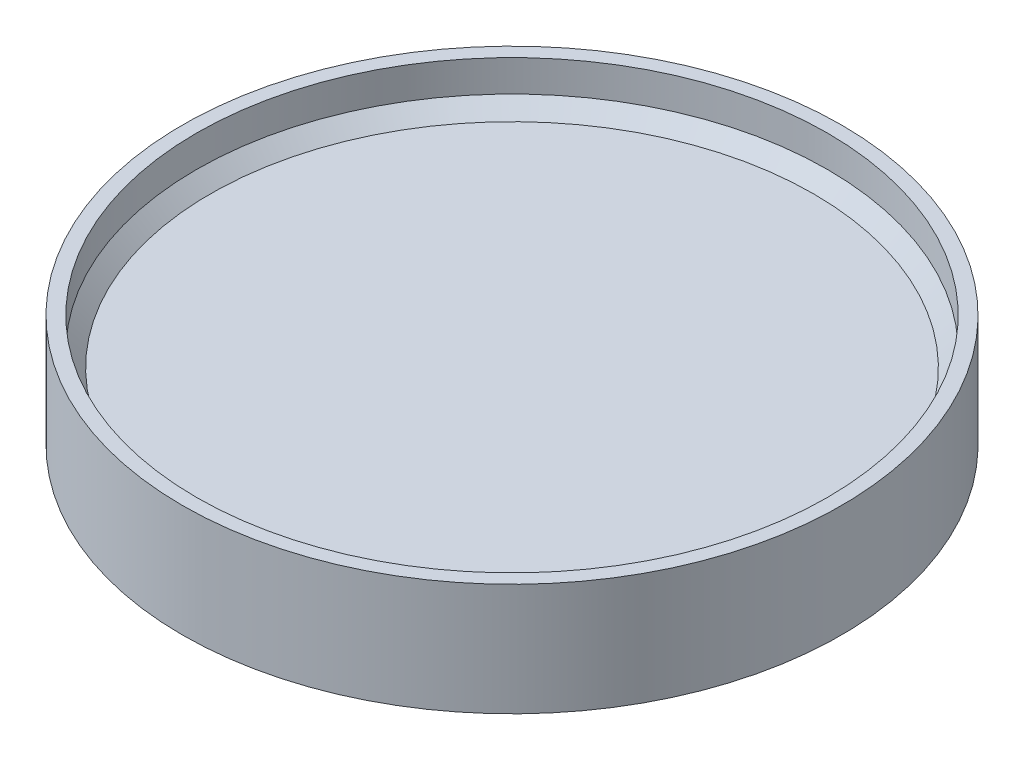
ISO-10303-21;
HEADER;
FILE_DESCRIPTION(('STEP AP214'),'2;1');
FILE_NAME('part.step','',(''),(''),'','','');
FILE_SCHEMA(('AUTOMOTIVE_DESIGN { 1 0 10303 214 1 1 1 1 }'));
ENDSEC;
DATA;
#1=APPLICATION_CONTEXT('core data for automotive mechanical design processes');
#2=APPLICATION_PROTOCOL_DEFINITION('international standard','automotive_design',2000,#1);
#3=PRODUCT_CONTEXT('',#1,'mechanical');
#4=PRODUCT('Part','Part','',(#3));
#5=PRODUCT_RELATED_PRODUCT_CATEGORY('part','',(#4));
#6=PRODUCT_DEFINITION_FORMATION('','',#4);
#7=PRODUCT_DEFINITION_CONTEXT('part definition',#1,'design');
#8=PRODUCT_DEFINITION('design','',#6,#7);
#9=PRODUCT_DEFINITION_SHAPE('','',#8);
#10=(LENGTH_UNIT() NAMED_UNIT(*) SI_UNIT(.MILLI.,.METRE.));
#11=(NAMED_UNIT(*) PLANE_ANGLE_UNIT() SI_UNIT($,.RADIAN.));
#12=(NAMED_UNIT(*) SI_UNIT($,.STERADIAN.) SOLID_ANGLE_UNIT());
#13=UNCERTAINTY_MEASURE_WITH_UNIT(LENGTH_MEASURE(1.E-05),#10,'distance_accuracy_value','');
#14=(GEOMETRIC_REPRESENTATION_CONTEXT(3) GLOBAL_UNCERTAINTY_ASSIGNED_CONTEXT((#13)) GLOBAL_UNIT_ASSIGNED_CONTEXT((#10,
#11,#12)) REPRESENTATION_CONTEXT('',''));
#15=CARTESIAN_POINT('',(0.,0.,0.));
#16=DIRECTION('',(0.,0.,1.));
#17=DIRECTION('',(1.,0.,0.));
#18=AXIS2_PLACEMENT_3D('',#15,#16,#17);
#19=CARTESIAN_POINT('',(0.,9.525,0.));
#20=DIRECTION('',(0.,1.,0.));
#21=DIRECTION('',(0.,0.,1.));
#22=AXIS2_PLACEMENT_3D('',#19,#20,#21);
#23=PLANE('',#22);
#24=CARTESIAN_POINT('',(0.,9.525,0.));
#25=DIRECTION('',(0.,1.,0.));
#26=DIRECTION('',(0.,0.,1.));
#27=AXIS2_PLACEMENT_3D('',#24,#25,#26);
#28=CIRCLE('',#27,136.525);
#29=CARTESIAN_POINT('',(0.,9.525,136.525));
#30=VERTEX_POINT('',#29);
#31=EDGE_CURVE('E10',#30,#30,#28,.T.);
#32=ORIENTED_EDGE('',*,*,#31,.T.);
#33=EDGE_LOOP('',(#32));
#34=FACE_BOUND('',#33,.T.);
#35=ADVANCED_FACE('F34',(#34),#23,.T.);
#36=CARTESIAN_POINT('',(0.,0.,0.));
#37=DIRECTION('',(0.,-1.,0.));
#38=DIRECTION('',(0.,0.,-1.));
#39=AXIS2_PLACEMENT_3D('',#36,#37,#38);
#40=CYLINDRICAL_SURFACE('',#39,142.875);
#41=CARTESIAN_POINT('',(0.,15.875,0.));
#42=DIRECTION('',(0.,1.,0.));
#43=DIRECTION('',(0.,0.,1.));
#44=AXIS2_PLACEMENT_3D('',#41,#42,#43);
#45=CIRCLE('',#44,142.875);
#46=CARTESIAN_POINT('',(0.,15.875,142.875));
#47=VERTEX_POINT('',#46);
#48=EDGE_CURVE('E41',#47,#47,#45,.F.);
#49=ORIENTED_EDGE('',*,*,#48,.T.);
#50=EDGE_LOOP('',(#49));
#51=FACE_BOUND('',#50,.T.);
#52=CARTESIAN_POINT('',(0.,30.1625,0.));
#53=DIRECTION('',(0.,-1.,0.));
#54=DIRECTION('',(0.,0.,-1.));
#55=AXIS2_PLACEMENT_3D('',#52,#53,#54);
#56=CIRCLE('',#55,142.875);
#57=CARTESIAN_POINT('',(0.,30.1625,-142.875));
#58=VERTEX_POINT('',#57);
#59=EDGE_CURVE('E54',#58,#58,#56,.T.);
#60=ORIENTED_EDGE('',*,*,#59,.F.);
#61=EDGE_LOOP('',(#60));
#62=FACE_BOUND('',#61,.T.);
#63=ADVANCED_FACE('F85',(#51,#62),#40,.F.);
#64=CARTESIAN_POINT('',(142.875,30.1625,0.));
#65=DIRECTION('',(0.,1.,0.));
#66=DIRECTION('',(0.,0.,1.));
#67=AXIS2_PLACEMENT_3D('',#64,#65,#66);
#68=PLANE('',#67);
#69=ORIENTED_EDGE('',*,*,#59,.T.);
#70=EDGE_LOOP('',(#69));
#71=FACE_BOUND('',#70,.T.);
#72=CARTESIAN_POINT('',(0.,30.1625,0.));
#73=DIRECTION('',(0.,-1.,0.));
#74=DIRECTION('',(0.,0.,-1.));
#75=AXIS2_PLACEMENT_3D('',#72,#73,#74);
#76=CIRCLE('',#75,149.225);
#77=CARTESIAN_POINT('',(0.,30.1625,-149.225));
#78=VERTEX_POINT('',#77);
#79=EDGE_CURVE('E57',#78,#78,#76,.T.);
#80=ORIENTED_EDGE('',*,*,#79,.F.);
#81=EDGE_LOOP('',(#80));
#82=FACE_BOUND('',#81,.T.);
#83=ADVANCED_FACE('F81',(#71,#82),#68,.T.);
#84=CARTESIAN_POINT('',(0.,0.,0.));
#85=DIRECTION('',(0.,-1.,0.));
#86=DIRECTION('',(0.,0.,-1.));
#87=AXIS2_PLACEMENT_3D('',#84,#85,#86);
#88=CYLINDRICAL_SURFACE('',#87,149.225);
#89=ORIENTED_EDGE('',*,*,#79,.T.);
#90=EDGE_LOOP('',(#89));
#91=FACE_BOUND('',#90,.T.);
#92=CARTESIAN_POINT('',(0.,-20.6375,0.));
#93=DIRECTION('',(0.,-1.,0.));
#94=DIRECTION('',(0.,0.,-1.));
#95=AXIS2_PLACEMENT_3D('',#92,#93,#94);
#96=CIRCLE('',#95,149.225);
#97=CARTESIAN_POINT('',(0.,-20.6375,-149.225));
#98=VERTEX_POINT('',#97);
#99=EDGE_CURVE('E60',#98,#98,#96,.T.);
#100=ORIENTED_EDGE('',*,*,#99,.F.);
#101=EDGE_LOOP('',(#100));
#102=FACE_BOUND('',#101,.T.);
#103=ADVANCED_FACE('F71',(#91,#102),#88,.T.);
#104=CARTESIAN_POINT('',(149.225,-20.6375,0.));
#105=DIRECTION('',(0.,-1.,0.));
#106=DIRECTION('',(0.,0.,-1.));
#107=AXIS2_PLACEMENT_3D('',#104,#105,#106);
#108=PLANE('',#107);
#109=ORIENTED_EDGE('',*,*,#99,.T.);
#110=EDGE_LOOP('',(#109));
#111=FACE_BOUND('',#110,.T.);
#112=CARTESIAN_POINT('',(0.,-20.6375,0.));
#113=DIRECTION('',(0.,-1.,0.));
#114=DIRECTION('',(0.,0.,-1.));
#115=AXIS2_PLACEMENT_3D('',#112,#113,#114);
#116=CIRCLE('',#115,142.875);
#117=CARTESIAN_POINT('',(0.,-20.6375,-142.875));
#118=VERTEX_POINT('',#117);
#119=EDGE_CURVE('E63',#118,#118,#116,.T.);
#120=ORIENTED_EDGE('',*,*,#119,.F.);
#121=EDGE_LOOP('',(#120));
#122=FACE_BOUND('',#121,.T.);
#123=ADVANCED_FACE('F69',(#111,#122),#108,.T.);
#124=CARTESIAN_POINT('',(0.,0.,0.));
#125=DIRECTION('',(0.,-1.,0.));
#126=DIRECTION('',(0.,0.,-1.));
#127=AXIS2_PLACEMENT_3D('',#124,#125,#126);
#128=CYLINDRICAL_SURFACE('',#127,142.875);
#129=CARTESIAN_POINT('',(0.,-6.34999999999996,0.));
#130=DIRECTION('',(0.,-1.,0.));
#131=DIRECTION('',(0.,0.,-1.));
#132=AXIS2_PLACEMENT_3D('',#129,#130,#131);
#133=CIRCLE('',#132,142.875);
#134=CARTESIAN_POINT('',(0.,-6.34999999999996,-142.875));
#135=VERTEX_POINT('',#134);
#136=EDGE_CURVE('E45',#135,#135,#133,.F.);
#137=ORIENTED_EDGE('',*,*,#136,.T.);
#138=EDGE_LOOP('',(#137));
#139=FACE_BOUND('',#138,.T.);
#140=ORIENTED_EDGE('',*,*,#119,.T.);
#141=EDGE_LOOP('',(#140));
#142=FACE_BOUND('',#141,.T.);
#143=ADVANCED_FACE('F67',(#139,#142),#128,.F.);
#144=CARTESIAN_POINT('',(142.875,0.,0.));
#145=DIRECTION('',(0.,-1.,0.));
#146=DIRECTION('',(0.,0.,-1.));
#147=AXIS2_PLACEMENT_3D('',#144,#145,#146);
#148=PLANE('',#147);
#149=CARTESIAN_POINT('',(0.,0.,0.));
#150=DIRECTION('',(0.,-1.,0.));
#151=DIRECTION('',(0.,0.,-1.));
#152=AXIS2_PLACEMENT_3D('',#149,#150,#151);
#153=CIRCLE('',#152,136.525);
#154=CARTESIAN_POINT('',(0.,0.,-136.525));
#155=VERTEX_POINT('',#154);
#156=EDGE_CURVE('E49',#155,#155,#153,.T.);
#157=ORIENTED_EDGE('',*,*,#156,.T.);
#158=EDGE_LOOP('',(#157));
#159=FACE_BOUND('',#158,.T.);
#160=ADVANCED_FACE('F78',(#159),#148,.T.);
#161=CARTESIAN_POINT('',(0.,0.,0.));
#162=DIRECTION('',(0.,-1.,0.));
#163=DIRECTION('',(0.,0.,-1.));
#164=AXIS2_PLACEMENT_3D('',#161,#162,#163);
#165=CONICAL_SURFACE('',#164,136.525,0.785398163397455);
#166=ORIENTED_EDGE('',*,*,#136,.F.);
#167=EDGE_LOOP('',(#166));
#168=FACE_BOUND('',#167,.T.);
#169=ORIENTED_EDGE('',*,*,#156,.F.);
#170=EDGE_LOOP('',(#169));
#171=FACE_BOUND('',#170,.T.);
#172=ADVANCED_FACE('F92',(#168,#171),#165,.F.);
#173=CARTESIAN_POINT('',(0.,15.875,0.));
#174=DIRECTION('',(0.,1.,0.));
#175=DIRECTION('',(0.,0.,1.));
#176=AXIS2_PLACEMENT_3D('',#173,#174,#175);
#177=CONICAL_SURFACE('',#176,142.875,0.785398163397444);
#178=ORIENTED_EDGE('',*,*,#31,.F.);
#179=EDGE_LOOP('',(#178));
#180=FACE_BOUND('',#179,.T.);
#181=ORIENTED_EDGE('',*,*,#48,.F.);
#182=EDGE_LOOP('',(#181));
#183=FACE_BOUND('',#182,.T.);
#184=ADVANCED_FACE('F36',(#180,#183),#177,.F.);
#185=CLOSED_SHELL('',(#35,#63,#83,#103,#123,#143,#160,#172,#184));
#186=MANIFOLD_SOLID_BREP('B2',#185);
#187=ADVANCED_BREP_SHAPE_REPRESENTATION('',(#18,#186),#14);
#188=SHAPE_DEFINITION_REPRESENTATION(#9,#187);
ENDSEC;
END-ISO-10303-21;
